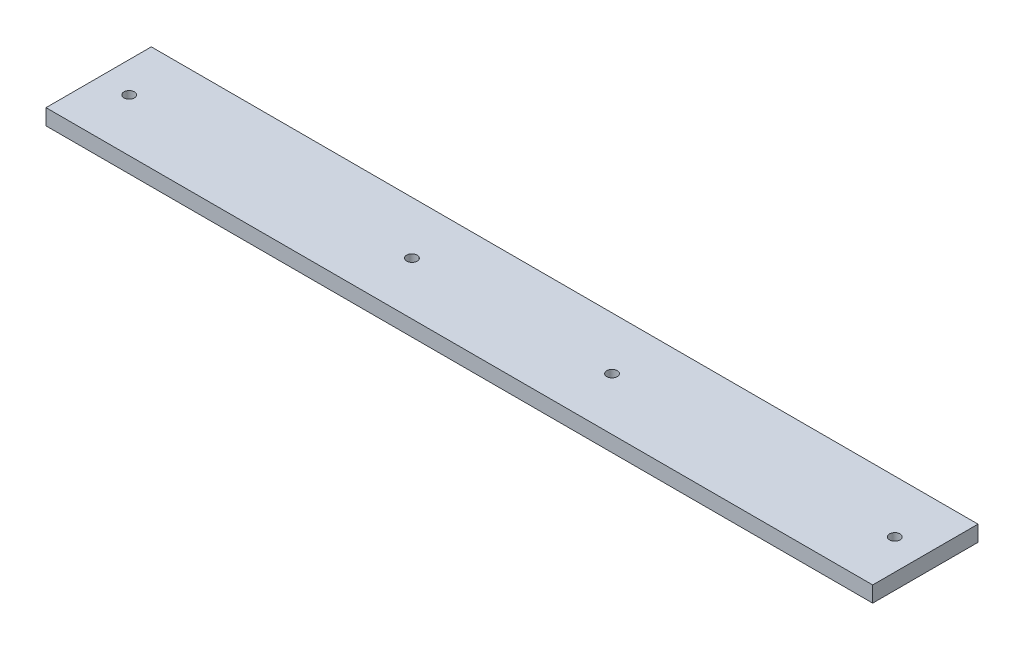
ISO-10303-21;
HEADER;
FILE_DESCRIPTION(('STEP AP214'),'2;1');
FILE_NAME('part.step','',(''),(''),'','','');
FILE_SCHEMA(('AUTOMOTIVE_DESIGN { 1 0 10303 214 1 1 1 1 }'));
ENDSEC;
DATA;
#1=APPLICATION_CONTEXT('core data for automotive mechanical design processes');
#2=APPLICATION_PROTOCOL_DEFINITION('international standard','automotive_design',2000,#1);
#3=PRODUCT_CONTEXT('',#1,'mechanical');
#4=PRODUCT('Part','Part','',(#3));
#5=PRODUCT_RELATED_PRODUCT_CATEGORY('part','',(#4));
#6=PRODUCT_DEFINITION_FORMATION('','',#4);
#7=PRODUCT_DEFINITION_CONTEXT('part definition',#1,'design');
#8=PRODUCT_DEFINITION('design','',#6,#7);
#9=PRODUCT_DEFINITION_SHAPE('','',#8);
#10=(LENGTH_UNIT() NAMED_UNIT(*) SI_UNIT(.MILLI.,.METRE.));
#11=(NAMED_UNIT(*) PLANE_ANGLE_UNIT() SI_UNIT($,.RADIAN.));
#12=(NAMED_UNIT(*) SI_UNIT($,.STERADIAN.) SOLID_ANGLE_UNIT());
#13=UNCERTAINTY_MEASURE_WITH_UNIT(LENGTH_MEASURE(1.E-05),#10,'distance_accuracy_value','');
#14=(GEOMETRIC_REPRESENTATION_CONTEXT(3) GLOBAL_UNCERTAINTY_ASSIGNED_CONTEXT((#13)) GLOBAL_UNIT_ASSIGNED_CONTEXT((#10,
#11,#12)) REPRESENTATION_CONTEXT('',''));
#15=CARTESIAN_POINT('',(0.,0.,0.));
#16=DIRECTION('',(0.,0.,1.));
#17=DIRECTION('',(1.,0.,0.));
#18=AXIS2_PLACEMENT_3D('',#15,#16,#17);
#19=CARTESIAN_POINT('',(-38.5634110787172,-15.,-7.66690962099125));
#20=DIRECTION('',(-1.,0.,0.));
#21=DIRECTION('',(0.,0.,1.));
#22=AXIS2_PLACEMENT_3D('',#19,#20,#21);
#23=PLANE('',#22);
#24=DIRECTION('',(0.,0.,1.));
#25=VECTOR('',#24,1.);
#26=CARTESIAN_POINT('',(-38.5634110787172,0.,-7.66690962099125));
#27=LINE('',#26,#25);
#28=CARTESIAN_POINT('',(-38.5634110787172,0.,-7.66690962099125));
#29=VERTEX_POINT('',#28);
#30=CARTESIAN_POINT('',(-38.5634110787172,0.,92.3330903790088));
#31=VERTEX_POINT('',#30);
#32=EDGE_CURVE('E99',#29,#31,#27,.T.);
#33=ORIENTED_EDGE('',*,*,#32,.F.);
#34=DIRECTION('',(0.,1.,0.));
#35=VECTOR('',#34,1.);
#36=CARTESIAN_POINT('',(-38.5634110787172,-15.,-7.66690962099125));
#37=LINE('',#36,#35);
#38=CARTESIAN_POINT('',(-38.5634110787172,-15.,-7.66690962099125));
#39=VERTEX_POINT('',#38);
#40=EDGE_CURVE('E11',#39,#29,#37,.T.);
#41=ORIENTED_EDGE('',*,*,#40,.F.);
#42=DIRECTION('',(0.,0.,1.));
#43=VECTOR('',#42,1.);
#44=CARTESIAN_POINT('',(-38.5634110787172,-15.,-7.66690962099125));
#45=LINE('',#44,#43);
#46=CARTESIAN_POINT('',(-38.5634110787172,-15.,92.3330903790088));
#47=VERTEX_POINT('',#46);
#48=EDGE_CURVE('E93',#39,#47,#45,.T.);
#49=ORIENTED_EDGE('',*,*,#48,.T.);
#50=DIRECTION('',(0.,1.,0.));
#51=VECTOR('',#50,1.);
#52=CARTESIAN_POINT('',(-38.5634110787172,-15.,92.3330903790088));
#53=LINE('',#52,#51);
#54=EDGE_CURVE('E36',#47,#31,#53,.T.);
#55=ORIENTED_EDGE('',*,*,#54,.T.);
#56=EDGE_LOOP('',(#33,#41,#49,#55));
#57=FACE_BOUND('',#56,.T.);
#58=ADVANCED_FACE('F33',(#57),#23,.T.);
#59=CARTESIAN_POINT('',(-38.5634110787172,-15.,-7.66690962099125));
#60=DIRECTION('',(0.,0.,1.));
#61=DIRECTION('',(1.,0.,0.));
#62=AXIS2_PLACEMENT_3D('',#59,#60,#61);
#63=PLANE('',#62);
#64=DIRECTION('',(1.,0.,0.));
#65=VECTOR('',#64,1.);
#66=CARTESIAN_POINT('',(-38.5634110787172,0.,-7.66690962099125));
#67=LINE('',#66,#65);
#68=CARTESIAN_POINT('',(746.436588921283,0.,-7.66690962099125));
#69=VERTEX_POINT('',#68);
#70=EDGE_CURVE('E66',#29,#69,#67,.T.);
#71=ORIENTED_EDGE('',*,*,#70,.T.);
#72=DIRECTION('',(0.,1.,0.));
#73=VECTOR('',#72,1.);
#74=CARTESIAN_POINT('',(746.436588921283,-15.,-7.66690962099125));
#75=LINE('',#74,#73);
#76=CARTESIAN_POINT('',(746.436588921283,-15.,-7.66690962099125));
#77=VERTEX_POINT('',#76);
#78=EDGE_CURVE('E42',#77,#69,#75,.T.);
#79=ORIENTED_EDGE('',*,*,#78,.F.);
#80=DIRECTION('',(1.,0.,0.));
#81=VECTOR('',#80,1.);
#82=CARTESIAN_POINT('',(-38.5634110787172,-15.,-7.66690962099125));
#83=LINE('',#82,#81);
#84=EDGE_CURVE('E83',#39,#77,#83,.T.);
#85=ORIENTED_EDGE('',*,*,#84,.F.);
#86=ORIENTED_EDGE('',*,*,#40,.T.);
#87=EDGE_LOOP('',(#71,#79,#85,#86));
#88=FACE_BOUND('',#87,.T.);
#89=ADVANCED_FACE('F110',(#88),#63,.F.);
#90=CARTESIAN_POINT('',(746.436588921283,-15.,-7.66690962099125));
#91=DIRECTION('',(-1.,0.,0.));
#92=DIRECTION('',(0.,0.,1.));
#93=AXIS2_PLACEMENT_3D('',#90,#91,#92);
#94=PLANE('',#93);
#95=DIRECTION('',(0.,0.,1.));
#96=VECTOR('',#95,1.);
#97=CARTESIAN_POINT('',(746.436588921283,0.,-7.66690962099125));
#98=LINE('',#97,#96);
#99=CARTESIAN_POINT('',(746.436588921283,0.,92.3330903790088));
#100=VERTEX_POINT('',#99);
#101=EDGE_CURVE('E90',#69,#100,#98,.T.);
#102=ORIENTED_EDGE('',*,*,#101,.T.);
#103=DIRECTION('',(0.,1.,0.));
#104=VECTOR('',#103,1.);
#105=CARTESIAN_POINT('',(746.436588921283,-15.,92.3330903790088));
#106=LINE('',#105,#104);
#107=CARTESIAN_POINT('',(746.436588921283,-15.,92.3330903790088));
#108=VERTEX_POINT('',#107);
#109=EDGE_CURVE('E87',#108,#100,#106,.T.);
#110=ORIENTED_EDGE('',*,*,#109,.F.);
#111=DIRECTION('',(0.,0.,1.));
#112=VECTOR('',#111,1.);
#113=CARTESIAN_POINT('',(746.436588921283,-15.,-7.66690962099125));
#114=LINE('',#113,#112);
#115=EDGE_CURVE('E78',#77,#108,#114,.T.);
#116=ORIENTED_EDGE('',*,*,#115,.F.);
#117=ORIENTED_EDGE('',*,*,#78,.T.);
#118=EDGE_LOOP('',(#102,#110,#116,#117));
#119=FACE_BOUND('',#118,.T.);
#120=ADVANCED_FACE('F88',(#119),#94,.F.);
#121=CARTESIAN_POINT('',(-38.5634110787172,-15.,92.3330903790088));
#122=DIRECTION('',(0.,0.,1.));
#123=DIRECTION('',(1.,0.,0.));
#124=AXIS2_PLACEMENT_3D('',#121,#122,#123);
#125=PLANE('',#124);
#126=DIRECTION('',(1.,0.,0.));
#127=VECTOR('',#126,1.);
#128=CARTESIAN_POINT('',(-38.5634110787172,0.,92.3330903790088));
#129=LINE('',#128,#127);
#130=EDGE_CURVE('E102',#31,#100,#129,.T.);
#131=ORIENTED_EDGE('',*,*,#130,.F.);
#132=ORIENTED_EDGE('',*,*,#54,.F.);
#133=DIRECTION('',(1.,0.,0.));
#134=VECTOR('',#133,1.);
#135=CARTESIAN_POINT('',(-38.5634110787172,-15.,92.3330903790088));
#136=LINE('',#135,#134);
#137=EDGE_CURVE('E82',#47,#108,#136,.T.);
#138=ORIENTED_EDGE('',*,*,#137,.T.);
#139=ORIENTED_EDGE('',*,*,#109,.T.);
#140=EDGE_LOOP('',(#131,#132,#138,#139));
#141=FACE_BOUND('',#140,.T.);
#142=ADVANCED_FACE('F92',(#141),#125,.T.);
#143=CARTESIAN_POINT('',(0.,-15.,0.));
#144=DIRECTION('',(0.,1.,0.));
#145=DIRECTION('',(0.,0.,1.));
#146=AXIS2_PLACEMENT_3D('',#143,#144,#145);
#147=PLANE('',#146);
#148=CARTESIAN_POINT('',(717.436588921283,-15.,42.3330903790088));
#149=DIRECTION('',(0.,1.,0.));
#150=DIRECTION('',(0.,0.,1.));
#151=AXIS2_PLACEMENT_3D('',#148,#149,#150);
#152=CIRCLE('',#151,5.00000000000005);
#153=CARTESIAN_POINT('',(717.436588921283,-15.,47.3330903790088));
#154=VERTEX_POINT('',#153);
#155=EDGE_CURVE('E152',#154,#154,#152,.T.);
#156=ORIENTED_EDGE('',*,*,#155,.T.);
#157=EDGE_LOOP('',(#156));
#158=FACE_BOUND('',#157,.T.);
#159=CARTESIAN_POINT('',(-9.56341107871719,-15.,42.3330903790088));
#160=DIRECTION('',(0.,1.,0.));
#161=DIRECTION('',(0.,0.,1.));
#162=AXIS2_PLACEMENT_3D('',#159,#160,#161);
#163=CIRCLE('',#162,5.);
#164=CARTESIAN_POINT('',(-9.56341107871719,-15.,47.3330903790088));
#165=VERTEX_POINT('',#164);
#166=EDGE_CURVE('E160',#165,#165,#163,.T.);
#167=ORIENTED_EDGE('',*,*,#166,.T.);
#168=EDGE_LOOP('',(#167));
#169=FACE_BOUND('',#168,.T.);
#170=CARTESIAN_POINT('',(448.936588921283,-15.,42.3330903790087));
#171=DIRECTION('',(0.,1.,0.));
#172=DIRECTION('',(0.,0.,1.));
#173=AXIS2_PLACEMENT_3D('',#170,#171,#172);
#174=CIRCLE('',#173,4.99999999999999);
#175=CARTESIAN_POINT('',(448.936588921283,-15.,47.3330903790087));
#176=VERTEX_POINT('',#175);
#177=EDGE_CURVE('E166',#176,#176,#174,.T.);
#178=ORIENTED_EDGE('',*,*,#177,.T.);
#179=EDGE_LOOP('',(#178));
#180=FACE_BOUND('',#179,.T.);
#181=CARTESIAN_POINT('',(258.936588921283,-15.,42.3330903790088));
#182=DIRECTION('',(0.,1.,0.));
#183=DIRECTION('',(0.,0.,1.));
#184=AXIS2_PLACEMENT_3D('',#181,#182,#183);
#185=CIRCLE('',#184,4.99999999999999);
#186=CARTESIAN_POINT('',(258.936588921283,-15.,47.3330903790088));
#187=VERTEX_POINT('',#186);
#188=EDGE_CURVE('E103',#187,#187,#185,.T.);
#189=ORIENTED_EDGE('',*,*,#188,.T.);
#190=EDGE_LOOP('',(#189));
#191=FACE_BOUND('',#190,.T.);
#192=ORIENTED_EDGE('',*,*,#48,.F.);
#193=ORIENTED_EDGE('',*,*,#84,.T.);
#194=ORIENTED_EDGE('',*,*,#115,.T.);
#195=ORIENTED_EDGE('',*,*,#137,.F.);
#196=EDGE_LOOP('',(#192,#193,#194,#195));
#197=FACE_BOUND('',#196,.T.);
#198=ADVANCED_FACE('F81',(#158,#169,#180,#191,#197),#147,.F.);
#199=CARTESIAN_POINT('',(0.,0.,0.));
#200=DIRECTION('',(0.,1.,0.));
#201=DIRECTION('',(0.,0.,1.));
#202=AXIS2_PLACEMENT_3D('',#199,#200,#201);
#203=PLANE('',#202);
#204=CARTESIAN_POINT('',(717.436588921283,0.,42.3330903790088));
#205=DIRECTION('',(0.,1.,0.));
#206=DIRECTION('',(0.,0.,1.));
#207=AXIS2_PLACEMENT_3D('',#204,#205,#206);
#208=CIRCLE('',#207,5.00000000000005);
#209=CARTESIAN_POINT('',(717.436588921283,0.,47.3330903790088));
#210=VERTEX_POINT('',#209);
#211=EDGE_CURVE('E155',#210,#210,#208,.T.);
#212=ORIENTED_EDGE('',*,*,#211,.F.);
#213=EDGE_LOOP('',(#212));
#214=FACE_BOUND('',#213,.T.);
#215=CARTESIAN_POINT('',(-9.56341107871719,0.,42.3330903790088));
#216=DIRECTION('',(0.,1.,0.));
#217=DIRECTION('',(0.,0.,1.));
#218=AXIS2_PLACEMENT_3D('',#215,#216,#217);
#219=CIRCLE('',#218,5.);
#220=CARTESIAN_POINT('',(-9.56341107871719,0.,47.3330903790088));
#221=VERTEX_POINT('',#220);
#222=EDGE_CURVE('E157',#221,#221,#219,.T.);
#223=ORIENTED_EDGE('',*,*,#222,.F.);
#224=EDGE_LOOP('',(#223));
#225=FACE_BOUND('',#224,.T.);
#226=CARTESIAN_POINT('',(448.936588921283,0.,42.3330903790087));
#227=DIRECTION('',(0.,1.,0.));
#228=DIRECTION('',(0.,0.,1.));
#229=AXIS2_PLACEMENT_3D('',#226,#227,#228);
#230=CIRCLE('',#229,4.99999999999999);
#231=CARTESIAN_POINT('',(448.936588921283,0.,47.3330903790087));
#232=VERTEX_POINT('',#231);
#233=EDGE_CURVE('E163',#232,#232,#230,.T.);
#234=ORIENTED_EDGE('',*,*,#233,.F.);
#235=EDGE_LOOP('',(#234));
#236=FACE_BOUND('',#235,.T.);
#237=CARTESIAN_POINT('',(258.936588921283,0.,42.3330903790088));
#238=DIRECTION('',(0.,1.,0.));
#239=DIRECTION('',(0.,0.,1.));
#240=AXIS2_PLACEMENT_3D('',#237,#238,#239);
#241=CIRCLE('',#240,4.99999999999999);
#242=CARTESIAN_POINT('',(258.936588921283,0.,47.3330903790088));
#243=VERTEX_POINT('',#242);
#244=EDGE_CURVE('E169',#243,#243,#241,.T.);
#245=ORIENTED_EDGE('',*,*,#244,.F.);
#246=EDGE_LOOP('',(#245));
#247=FACE_BOUND('',#246,.T.);
#248=ORIENTED_EDGE('',*,*,#32,.T.);
#249=ORIENTED_EDGE('',*,*,#130,.T.);
#250=ORIENTED_EDGE('',*,*,#101,.F.);
#251=ORIENTED_EDGE('',*,*,#70,.F.);
#252=EDGE_LOOP('',(#248,#249,#250,#251));
#253=FACE_BOUND('',#252,.T.);
#254=ADVANCED_FACE('F108',(#214,#225,#236,#247,#253),#203,.T.);
#255=CARTESIAN_POINT('',(258.936588921283,-15.,42.3330903790088));
#256=DIRECTION('',(0.,1.,0.));
#257=DIRECTION('',(0.,0.,1.));
#258=AXIS2_PLACEMENT_3D('',#255,#256,#257);
#259=CYLINDRICAL_SURFACE('',#258,4.99999999999999);
#260=ORIENTED_EDGE('',*,*,#188,.F.);
#261=EDGE_LOOP('',(#260));
#262=FACE_BOUND('',#261,.T.);
#263=ORIENTED_EDGE('',*,*,#244,.T.);
#264=EDGE_LOOP('',(#263));
#265=FACE_BOUND('',#264,.T.);
#266=ADVANCED_FACE('F129',(#262,#265),#259,.F.);
#267=CARTESIAN_POINT('',(448.936588921283,-15.,42.3330903790087));
#268=DIRECTION('',(0.,1.,0.));
#269=DIRECTION('',(0.,0.,1.));
#270=AXIS2_PLACEMENT_3D('',#267,#268,#269);
#271=CYLINDRICAL_SURFACE('',#270,4.99999999999999);
#272=ORIENTED_EDGE('',*,*,#177,.F.);
#273=EDGE_LOOP('',(#272));
#274=FACE_BOUND('',#273,.T.);
#275=ORIENTED_EDGE('',*,*,#233,.T.);
#276=EDGE_LOOP('',(#275));
#277=FACE_BOUND('',#276,.T.);
#278=ADVANCED_FACE('F136',(#274,#277),#271,.F.);
#279=CARTESIAN_POINT('',(-9.56341107871719,-15.,42.3330903790088));
#280=DIRECTION('',(0.,1.,0.));
#281=DIRECTION('',(0.,0.,1.));
#282=AXIS2_PLACEMENT_3D('',#279,#280,#281);
#283=CYLINDRICAL_SURFACE('',#282,5.);
#284=ORIENTED_EDGE('',*,*,#166,.F.);
#285=EDGE_LOOP('',(#284));
#286=FACE_BOUND('',#285,.T.);
#287=ORIENTED_EDGE('',*,*,#222,.T.);
#288=EDGE_LOOP('',(#287));
#289=FACE_BOUND('',#288,.T.);
#290=ADVANCED_FACE('F140',(#286,#289),#283,.F.);
#291=CARTESIAN_POINT('',(717.436588921283,-15.,42.3330903790088));
#292=DIRECTION('',(0.,1.,0.));
#293=DIRECTION('',(0.,0.,1.));
#294=AXIS2_PLACEMENT_3D('',#291,#292,#293);
#295=CYLINDRICAL_SURFACE('',#294,5.00000000000005);
#296=ORIENTED_EDGE('',*,*,#155,.F.);
#297=EDGE_LOOP('',(#296));
#298=FACE_BOUND('',#297,.T.);
#299=ORIENTED_EDGE('',*,*,#211,.T.);
#300=EDGE_LOOP('',(#299));
#301=FACE_BOUND('',#300,.T.);
#302=ADVANCED_FACE('F144',(#298,#301),#295,.F.);
#303=CLOSED_SHELL('',(#58,#89,#120,#142,#198,#254,#266,#278,#290,#302));
#304=MANIFOLD_SOLID_BREP('B2',#303);
#305=ADVANCED_BREP_SHAPE_REPRESENTATION('',(#18,#304),#14);
#306=SHAPE_DEFINITION_REPRESENTATION(#9,#305);
ENDSEC;
END-ISO-10303-21;
